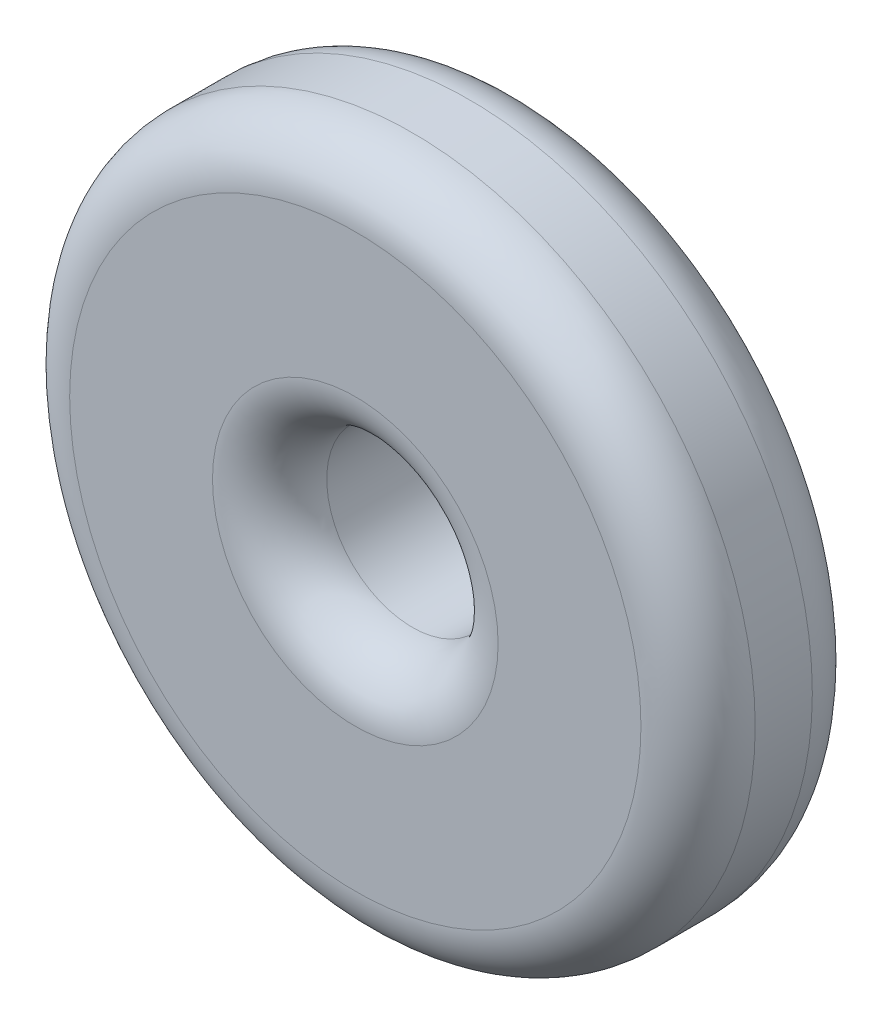
ISO-10303-21;
HEADER;
FILE_DESCRIPTION(('STEP AP214'),'2;1');
FILE_NAME('part.step','',(''),(''),'','','');
FILE_SCHEMA(('AUTOMOTIVE_DESIGN { 1 0 10303 214 1 1 1 1 }'));
ENDSEC;
DATA;
#1=APPLICATION_CONTEXT('core data for automotive mechanical design processes');
#2=APPLICATION_PROTOCOL_DEFINITION('international standard','automotive_design',2000,#1);
#3=PRODUCT_CONTEXT('',#1,'mechanical');
#4=PRODUCT('Part','Part','',(#3));
#5=PRODUCT_RELATED_PRODUCT_CATEGORY('part','',(#4));
#6=PRODUCT_DEFINITION_FORMATION('','',#4);
#7=PRODUCT_DEFINITION_CONTEXT('part definition',#1,'design');
#8=PRODUCT_DEFINITION('design','',#6,#7);
#9=PRODUCT_DEFINITION_SHAPE('','',#8);
#10=(LENGTH_UNIT() NAMED_UNIT(*) SI_UNIT(.MILLI.,.METRE.));
#11=(NAMED_UNIT(*) PLANE_ANGLE_UNIT() SI_UNIT($,.RADIAN.));
#12=(NAMED_UNIT(*) SI_UNIT($,.STERADIAN.) SOLID_ANGLE_UNIT());
#13=UNCERTAINTY_MEASURE_WITH_UNIT(LENGTH_MEASURE(1.E-05),#10,'distance_accuracy_value','');
#14=(GEOMETRIC_REPRESENTATION_CONTEXT(3) GLOBAL_UNCERTAINTY_ASSIGNED_CONTEXT((#13)) GLOBAL_UNIT_ASSIGNED_CONTEXT((#10,
#11,#12)) REPRESENTATION_CONTEXT('',''));
#15=CARTESIAN_POINT('',(0.,0.,0.));
#16=DIRECTION('',(0.,0.,1.));
#17=DIRECTION('',(1.,0.,0.));
#18=AXIS2_PLACEMENT_3D('',#15,#16,#17);
#19=CARTESIAN_POINT('',(0.,0.,3.));
#20=DIRECTION('',(0.,0.,1.));
#21=DIRECTION('',(1.,0.,0.));
#22=AXIS2_PLACEMENT_3D('',#19,#20,#21);
#23=PLANE('',#22);
#24=CARTESIAN_POINT('',(0.,0.,3.));
#25=DIRECTION('',(0.,0.,1.));
#26=DIRECTION('',(1.,0.,0.));
#27=AXIS2_PLACEMENT_3D('',#24,#25,#26);
#28=CIRCLE('',#27,2.5);
#29=CARTESIAN_POINT('',(2.5,0.,3.));
#30=VERTEX_POINT('',#29);
#31=EDGE_CURVE('E50',#30,#30,#28,.F.);
#32=ORIENTED_EDGE('',*,*,#31,.T.);
#33=EDGE_LOOP('',(#32));
#34=FACE_BOUND('',#33,.T.);
#35=CARTESIAN_POINT('',(0.,0.,3.));
#36=DIRECTION('',(0.,0.,1.));
#37=DIRECTION('',(1.,0.,0.));
#38=AXIS2_PLACEMENT_3D('',#35,#36,#37);
#39=CIRCLE('',#38,5.);
#40=CARTESIAN_POINT('',(5.,0.,3.));
#41=VERTEX_POINT('',#40);
#42=EDGE_CURVE('E55',#41,#41,#39,.T.);
#43=ORIENTED_EDGE('',*,*,#42,.T.);
#44=EDGE_LOOP('',(#43));
#45=FACE_BOUND('',#44,.T.);
#46=ADVANCED_FACE('F42',(#34,#45),#23,.T.);
#47=CARTESIAN_POINT('',(0.,0.,0.));
#48=DIRECTION('',(0.,0.,1.));
#49=DIRECTION('',(1.,0.,0.));
#50=AXIS2_PLACEMENT_3D('',#47,#48,#49);
#51=PLANE('',#50);
#52=CARTESIAN_POINT('',(0.,0.,0.));
#53=DIRECTION('',(0.,0.,1.));
#54=DIRECTION('',(1.,0.,0.));
#55=AXIS2_PLACEMENT_3D('',#52,#53,#54);
#56=CIRCLE('',#55,5.);
#57=CARTESIAN_POINT('',(5.,0.,0.));
#58=VERTEX_POINT('',#57);
#59=EDGE_CURVE('E66',#58,#58,#56,.F.);
#60=ORIENTED_EDGE('',*,*,#59,.T.);
#61=EDGE_LOOP('',(#60));
#62=FACE_BOUND('',#61,.T.);
#63=CARTESIAN_POINT('',(0.,0.,0.));
#64=DIRECTION('',(0.,0.,1.));
#65=DIRECTION('',(1.,0.,0.));
#66=AXIS2_PLACEMENT_3D('',#63,#64,#65);
#67=CIRCLE('',#66,1.5);
#68=CARTESIAN_POINT('',(1.5,0.,0.));
#69=VERTEX_POINT('',#68);
#70=EDGE_CURVE('E74',#69,#69,#67,.T.);
#71=ORIENTED_EDGE('',*,*,#70,.T.);
#72=EDGE_LOOP('',(#71));
#73=FACE_BOUND('',#72,.T.);
#74=ADVANCED_FACE('F79',(#62,#73),#51,.F.);
#75=CARTESIAN_POINT('',(0.,0.,3.));
#76=DIRECTION('',(0.,0.,-1.));
#77=DIRECTION('',(-1.,0.,0.));
#78=AXIS2_PLACEMENT_3D('',#75,#76,#77);
#79=CYLINDRICAL_SURFACE('',#78,6.);
#80=CARTESIAN_POINT('',(0.,0.,2.));
#81=DIRECTION('',(0.,0.,1.));
#82=DIRECTION('',(1.,0.,0.));
#83=AXIS2_PLACEMENT_3D('',#80,#81,#82);
#84=CIRCLE('',#83,6.);
#85=CARTESIAN_POINT('',(6.,0.,2.));
#86=VERTEX_POINT('',#85);
#87=EDGE_CURVE('E11',#86,#86,#84,.F.);
#88=ORIENTED_EDGE('',*,*,#87,.T.);
#89=EDGE_LOOP('',(#88));
#90=FACE_BOUND('',#89,.T.);
#91=CARTESIAN_POINT('',(0.,0.,1.));
#92=DIRECTION('',(0.,0.,1.));
#93=DIRECTION('',(1.,0.,0.));
#94=AXIS2_PLACEMENT_3D('',#91,#92,#93);
#95=CIRCLE('',#94,6.);
#96=CARTESIAN_POINT('',(6.,0.,1.));
#97=VERTEX_POINT('',#96);
#98=EDGE_CURVE('E70',#97,#97,#95,.T.);
#99=ORIENTED_EDGE('',*,*,#98,.T.);
#100=EDGE_LOOP('',(#99));
#101=FACE_BOUND('',#100,.T.);
#102=ADVANCED_FACE('F84',(#90,#101),#79,.T.);
#103=CARTESIAN_POINT('',(0.,0.,3.));
#104=DIRECTION('',(0.,0.,-1.));
#105=DIRECTION('',(-1.,0.,0.));
#106=AXIS2_PLACEMENT_3D('',#103,#104,#105);
#107=CYLINDRICAL_SURFACE('',#106,1.5);
#108=CARTESIAN_POINT('',(0.,0.,2.));
#109=DIRECTION('',(0.,0.,1.));
#110=DIRECTION('',(1.,0.,0.));
#111=AXIS2_PLACEMENT_3D('',#108,#109,#110);
#112=CIRCLE('',#111,1.5);
#113=CARTESIAN_POINT('',(1.5,0.,2.));
#114=VERTEX_POINT('',#113);
#115=EDGE_CURVE('E60',#114,#114,#112,.T.);
#116=ORIENTED_EDGE('',*,*,#115,.T.);
#117=EDGE_LOOP('',(#116));
#118=FACE_BOUND('',#117,.T.);
#119=ORIENTED_EDGE('',*,*,#70,.F.);
#120=EDGE_LOOP('',(#119));
#121=FACE_BOUND('',#120,.T.);
#122=ADVANCED_FACE('F81',(#118,#121),#107,.F.);
#123=CARTESIAN_POINT('',(0.,0.,1.));
#124=DIRECTION('',(0.,0.,1.));
#125=DIRECTION('',(1.,0.,0.));
#126=AXIS2_PLACEMENT_3D('',#123,#124,#125);
#127=TOROIDAL_SURFACE('',#126,5.,1.);
#128=ORIENTED_EDGE('',*,*,#59,.F.);
#129=EDGE_LOOP('',(#128));
#130=FACE_BOUND('',#129,.T.);
#131=ORIENTED_EDGE('',*,*,#98,.F.);
#132=EDGE_LOOP('',(#131));
#133=FACE_BOUND('',#132,.T.);
#134=ADVANCED_FACE('F83',(#130,#133),#127,.T.);
#135=CARTESIAN_POINT('',(0.,0.,2.));
#136=DIRECTION('',(0.,0.,1.));
#137=DIRECTION('',(1.,0.,0.));
#138=AXIS2_PLACEMENT_3D('',#135,#136,#137);
#139=TOROIDAL_SURFACE('',#138,2.5,1.);
#140=ORIENTED_EDGE('',*,*,#31,.F.);
#141=EDGE_LOOP('',(#140));
#142=FACE_BOUND('',#141,.T.);
#143=ORIENTED_EDGE('',*,*,#115,.F.);
#144=EDGE_LOOP('',(#143));
#145=FACE_BOUND('',#144,.T.);
#146=ADVANCED_FACE('F92',(#142,#145),#139,.T.);
#147=CARTESIAN_POINT('',(0.,0.,2.));
#148=DIRECTION('',(0.,0.,1.));
#149=DIRECTION('',(1.,0.,0.));
#150=AXIS2_PLACEMENT_3D('',#147,#148,#149);
#151=TOROIDAL_SURFACE('',#150,5.,1.);
#152=ORIENTED_EDGE('',*,*,#87,.F.);
#153=EDGE_LOOP('',(#152));
#154=FACE_BOUND('',#153,.T.);
#155=ORIENTED_EDGE('',*,*,#42,.F.);
#156=EDGE_LOOP('',(#155));
#157=FACE_BOUND('',#156,.T.);
#158=ADVANCED_FACE('F44',(#154,#157),#151,.T.);
#159=CLOSED_SHELL('',(#46,#74,#102,#122,#134,#146,#158));
#160=MANIFOLD_SOLID_BREP('B2',#159);
#161=ADVANCED_BREP_SHAPE_REPRESENTATION('',(#18,#160),#14);
#162=SHAPE_DEFINITION_REPRESENTATION(#9,#161);
ENDSEC;
END-ISO-10303-21;
